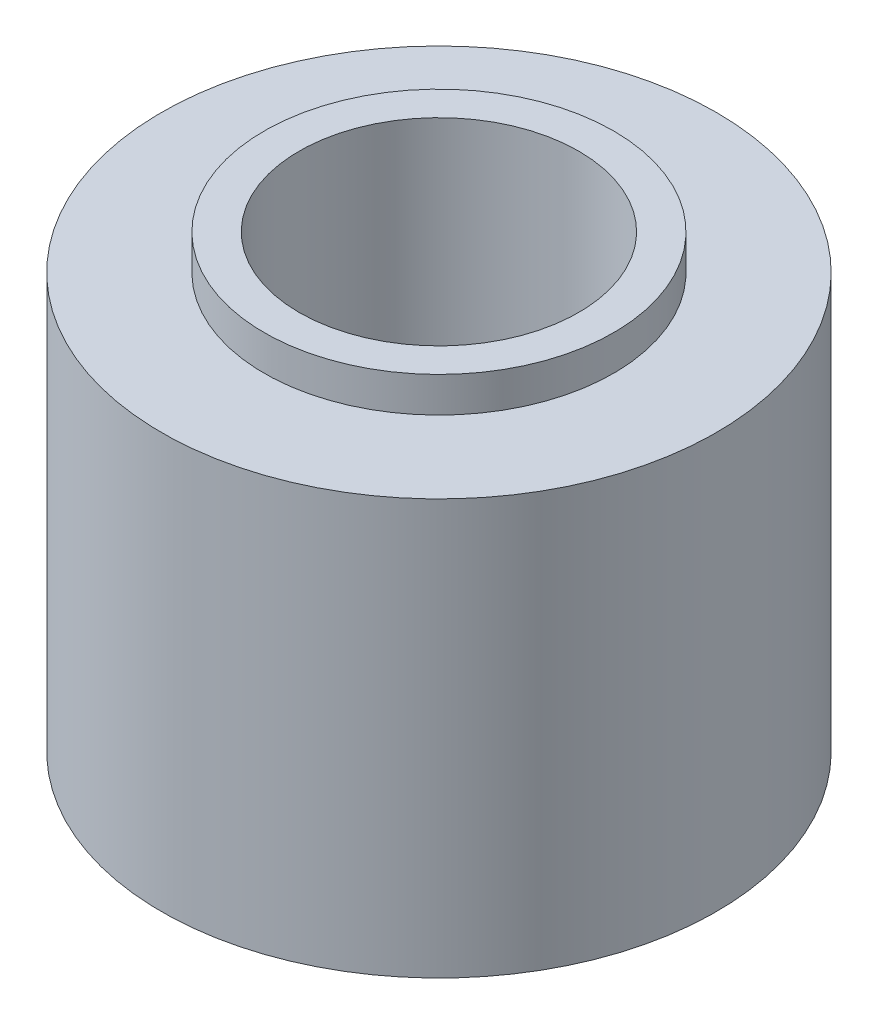
ISO-10303-21;
HEADER;
FILE_DESCRIPTION(('STEP AP214'),'2;1');
FILE_NAME('part.step','',(''),(''),'','','');
FILE_SCHEMA(('AUTOMOTIVE_DESIGN { 1 0 10303 214 1 1 1 1 }'));
ENDSEC;
DATA;
#1=APPLICATION_CONTEXT('core data for automotive mechanical design processes');
#2=APPLICATION_PROTOCOL_DEFINITION('international standard','automotive_design',2000,#1);
#3=PRODUCT_CONTEXT('',#1,'mechanical');
#4=PRODUCT('Part','Part','',(#3));
#5=PRODUCT_RELATED_PRODUCT_CATEGORY('part','',(#4));
#6=PRODUCT_DEFINITION_FORMATION('','',#4);
#7=PRODUCT_DEFINITION_CONTEXT('part definition',#1,'design');
#8=PRODUCT_DEFINITION('design','',#6,#7);
#9=PRODUCT_DEFINITION_SHAPE('','',#8);
#10=(LENGTH_UNIT() NAMED_UNIT(*) SI_UNIT(.MILLI.,.METRE.));
#11=(NAMED_UNIT(*) PLANE_ANGLE_UNIT() SI_UNIT($,.RADIAN.));
#12=(NAMED_UNIT(*) SI_UNIT($,.STERADIAN.) SOLID_ANGLE_UNIT());
#13=UNCERTAINTY_MEASURE_WITH_UNIT(LENGTH_MEASURE(1.E-05),#10,'distance_accuracy_value','');
#14=(GEOMETRIC_REPRESENTATION_CONTEXT(3) GLOBAL_UNCERTAINTY_ASSIGNED_CONTEXT((#13)) GLOBAL_UNIT_ASSIGNED_CONTEXT((#10,
#11,#12)) REPRESENTATION_CONTEXT('',''));
#15=CARTESIAN_POINT('',(0.,0.,0.));
#16=DIRECTION('',(0.,0.,1.));
#17=DIRECTION('',(1.,0.,0.));
#18=AXIS2_PLACEMENT_3D('',#15,#16,#17);
#19=CARTESIAN_POINT('',(0.,5.55625,0.));
#20=DIRECTION('',(0.,1.,0.));
#21=DIRECTION('',(0.,0.,1.));
#22=AXIS2_PLACEMENT_3D('',#19,#20,#21);
#23=CYLINDRICAL_SURFACE('',#22,6.35);
#24=CARTESIAN_POINT('',(0.,4.75,0.));
#25=DIRECTION('',(0.,-1.,0.));
#26=DIRECTION('',(0.,0.,-1.));
#27=AXIS2_PLACEMENT_3D('',#24,#25,#26);
#28=CIRCLE('',#27,6.35);
#29=CARTESIAN_POINT('',(0.,4.75,-6.35));
#30=VERTEX_POINT('',#29);
#31=EDGE_CURVE('E40',#30,#30,#28,.T.);
#32=ORIENTED_EDGE('',*,*,#31,.T.);
#33=EDGE_LOOP('',(#32));
#34=FACE_BOUND('',#33,.T.);
#35=CARTESIAN_POINT('',(0.,-4.75,0.));
#36=DIRECTION('',(0.,-1.,0.));
#37=DIRECTION('',(0.,0.,-1.));
#38=AXIS2_PLACEMENT_3D('',#35,#36,#37);
#39=CIRCLE('',#38,6.35);
#40=CARTESIAN_POINT('',(0.,-4.75,-6.35));
#41=VERTEX_POINT('',#40);
#42=EDGE_CURVE('E52',#41,#41,#39,.T.);
#43=ORIENTED_EDGE('',*,*,#42,.F.);
#44=EDGE_LOOP('',(#43));
#45=FACE_BOUND('',#44,.T.);
#46=ADVANCED_FACE('F29',(#34,#45),#23,.T.);
#47=CARTESIAN_POINT('',(3.2004,-5.55625,0.));
#48=DIRECTION('',(0.,1.,0.));
#49=DIRECTION('',(0.,0.,1.));
#50=AXIS2_PLACEMENT_3D('',#47,#48,#49);
#51=PLANE('',#50);
#52=CARTESIAN_POINT('',(0.,-5.55625,0.));
#53=DIRECTION('',(0.,1.,0.));
#54=DIRECTION('',(0.,0.,1.));
#55=AXIS2_PLACEMENT_3D('',#52,#53,#54);
#56=CIRCLE('',#55,3.2004);
#57=CARTESIAN_POINT('',(0.,-5.55625,3.2004));
#58=VERTEX_POINT('',#57);
#59=EDGE_CURVE('E10',#58,#58,#56,.T.);
#60=ORIENTED_EDGE('',*,*,#59,.T.);
#61=EDGE_LOOP('',(#60));
#62=FACE_BOUND('',#61,.T.);
#63=CARTESIAN_POINT('',(0.,-5.55625,0.));
#64=DIRECTION('',(0.,-1.,0.));
#65=DIRECTION('',(0.,0.,-1.));
#66=AXIS2_PLACEMENT_3D('',#63,#64,#65);
#67=CIRCLE('',#66,4.);
#68=CARTESIAN_POINT('',(0.,-5.55625,-4.));
#69=VERTEX_POINT('',#68);
#70=EDGE_CURVE('E58',#69,#69,#67,.T.);
#71=ORIENTED_EDGE('',*,*,#70,.T.);
#72=EDGE_LOOP('',(#71));
#73=FACE_BOUND('',#72,.T.);
#74=ADVANCED_FACE('F62',(#62,#73),#51,.F.);
#75=CARTESIAN_POINT('',(3.2004,5.55625,0.));
#76=DIRECTION('',(0.,-1.,0.));
#77=DIRECTION('',(0.,0.,-1.));
#78=AXIS2_PLACEMENT_3D('',#75,#76,#77);
#79=PLANE('',#78);
#80=CARTESIAN_POINT('',(0.,5.55625,0.));
#81=DIRECTION('',(0.,1.,0.));
#82=DIRECTION('',(0.,0.,1.));
#83=AXIS2_PLACEMENT_3D('',#80,#81,#82);
#84=CIRCLE('',#83,3.2004);
#85=CARTESIAN_POINT('',(0.,5.55625,3.2004));
#86=VERTEX_POINT('',#85);
#87=EDGE_CURVE('E36',#86,#86,#84,.T.);
#88=ORIENTED_EDGE('',*,*,#87,.F.);
#89=EDGE_LOOP('',(#88));
#90=FACE_BOUND('',#89,.T.);
#91=CARTESIAN_POINT('',(0.,5.55625,0.));
#92=DIRECTION('',(0.,-1.,0.));
#93=DIRECTION('',(0.,0.,-1.));
#94=AXIS2_PLACEMENT_3D('',#91,#92,#93);
#95=CIRCLE('',#94,4.);
#96=CARTESIAN_POINT('',(0.,5.55625,-4.));
#97=VERTEX_POINT('',#96);
#98=EDGE_CURVE('E49',#97,#97,#95,.T.);
#99=ORIENTED_EDGE('',*,*,#98,.F.);
#100=EDGE_LOOP('',(#99));
#101=FACE_BOUND('',#100,.T.);
#102=ADVANCED_FACE('F81',(#90,#101),#79,.F.);
#103=CARTESIAN_POINT('',(0.,5.55625,0.));
#104=DIRECTION('',(0.,1.,0.));
#105=DIRECTION('',(0.,0.,1.));
#106=AXIS2_PLACEMENT_3D('',#103,#104,#105);
#107=CYLINDRICAL_SURFACE('',#106,3.2004);
#108=ORIENTED_EDGE('',*,*,#59,.F.);
#109=EDGE_LOOP('',(#108));
#110=FACE_BOUND('',#109,.T.);
#111=ORIENTED_EDGE('',*,*,#87,.T.);
#112=EDGE_LOOP('',(#111));
#113=FACE_BOUND('',#112,.T.);
#114=ADVANCED_FACE('F31',(#110,#113),#107,.F.);
#115=CARTESIAN_POINT('',(-6.35,4.75,0.));
#116=DIRECTION('',(0.,1.,0.));
#117=DIRECTION('',(0.,0.,1.));
#118=AXIS2_PLACEMENT_3D('',#115,#116,#117);
#119=PLANE('',#118);
#120=CARTESIAN_POINT('',(0.,4.75,0.));
#121=DIRECTION('',(0.,-1.,0.));
#122=DIRECTION('',(0.,0.,-1.));
#123=AXIS2_PLACEMENT_3D('',#120,#121,#122);
#124=CIRCLE('',#123,4.);
#125=CARTESIAN_POINT('',(0.,4.75,-4.));
#126=VERTEX_POINT('',#125);
#127=EDGE_CURVE('E44',#126,#126,#124,.T.);
#128=ORIENTED_EDGE('',*,*,#127,.T.);
#129=EDGE_LOOP('',(#128));
#130=FACE_BOUND('',#129,.T.);
#131=ORIENTED_EDGE('',*,*,#31,.F.);
#132=EDGE_LOOP('',(#131));
#133=FACE_BOUND('',#132,.T.);
#134=ADVANCED_FACE('F87',(#130,#133),#119,.T.);
#135=CARTESIAN_POINT('',(0.,-6.04486441400098,0.));
#136=DIRECTION('',(0.,-1.,0.));
#137=DIRECTION('',(0.,0.,-1.));
#138=AXIS2_PLACEMENT_3D('',#135,#136,#137);
#139=CYLINDRICAL_SURFACE('',#138,4.);
#140=ORIENTED_EDGE('',*,*,#98,.T.);
#141=EDGE_LOOP('',(#140));
#142=FACE_BOUND('',#141,.T.);
#143=ORIENTED_EDGE('',*,*,#127,.F.);
#144=EDGE_LOOP('',(#143));
#145=FACE_BOUND('',#144,.T.);
#146=ADVANCED_FACE('F72',(#142,#145),#139,.T.);
#147=CARTESIAN_POINT('',(-6.35,-4.75,0.));
#148=DIRECTION('',(0.,-1.,0.));
#149=DIRECTION('',(0.,0.,-1.));
#150=AXIS2_PLACEMENT_3D('',#147,#148,#149);
#151=PLANE('',#150);
#152=ORIENTED_EDGE('',*,*,#42,.T.);
#153=EDGE_LOOP('',(#152));
#154=FACE_BOUND('',#153,.T.);
#155=CARTESIAN_POINT('',(0.,-4.75,0.));
#156=DIRECTION('',(0.,-1.,0.));
#157=DIRECTION('',(0.,0.,-1.));
#158=AXIS2_PLACEMENT_3D('',#155,#156,#157);
#159=CIRCLE('',#158,4.);
#160=CARTESIAN_POINT('',(0.,-4.75,-4.));
#161=VERTEX_POINT('',#160);
#162=EDGE_CURVE('E55',#161,#161,#159,.T.);
#163=ORIENTED_EDGE('',*,*,#162,.F.);
#164=EDGE_LOOP('',(#163));
#165=FACE_BOUND('',#164,.T.);
#166=ADVANCED_FACE('F66',(#154,#165),#151,.T.);
#167=CARTESIAN_POINT('',(0.,-6.04486441400098,0.));
#168=DIRECTION('',(0.,-1.,0.));
#169=DIRECTION('',(0.,0.,-1.));
#170=AXIS2_PLACEMENT_3D('',#167,#168,#169);
#171=CYLINDRICAL_SURFACE('',#170,4.);
#172=ORIENTED_EDGE('',*,*,#162,.T.);
#173=EDGE_LOOP('',(#172));
#174=FACE_BOUND('',#173,.T.);
#175=ORIENTED_EDGE('',*,*,#70,.F.);
#176=EDGE_LOOP('',(#175));
#177=FACE_BOUND('',#176,.T.);
#178=ADVANCED_FACE('F64',(#174,#177),#171,.T.);
#179=CLOSED_SHELL('',(#46,#74,#102,#114,#134,#146,#166,#178));
#180=MANIFOLD_SOLID_BREP('B2',#179);
#181=ADVANCED_BREP_SHAPE_REPRESENTATION('',(#18,#180),#14);
#182=SHAPE_DEFINITION_REPRESENTATION(#9,#181);
ENDSEC;
END-ISO-10303-21;
